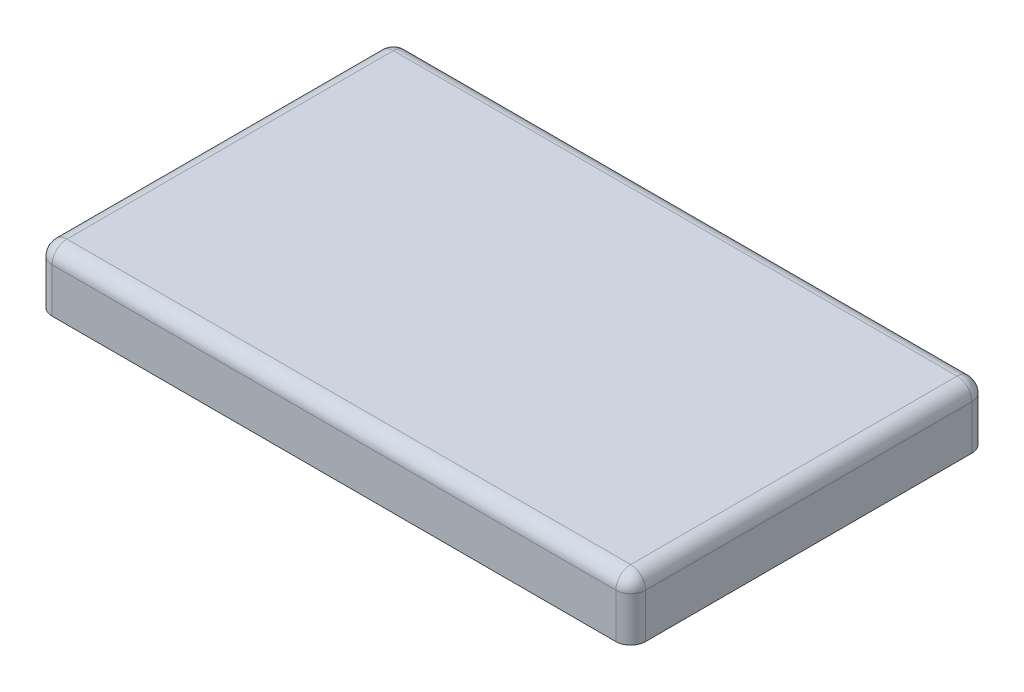
ISO-10303-21;
HEADER;
FILE_DESCRIPTION(('STEP AP214'),'2;1');
FILE_NAME('part.step','',(''),(''),'','','');
FILE_SCHEMA(('AUTOMOTIVE_DESIGN { 1 0 10303 214 1 1 1 1 }'));
ENDSEC;
DATA;
#1=APPLICATION_CONTEXT('core data for automotive mechanical design processes');
#2=APPLICATION_PROTOCOL_DEFINITION('international standard','automotive_design',2000,#1);
#3=PRODUCT_CONTEXT('',#1,'mechanical');
#4=PRODUCT('Part','Part','',(#3));
#5=PRODUCT_RELATED_PRODUCT_CATEGORY('part','',(#4));
#6=PRODUCT_DEFINITION_FORMATION('','',#4);
#7=PRODUCT_DEFINITION_CONTEXT('part definition',#1,'design');
#8=PRODUCT_DEFINITION('design','',#6,#7);
#9=PRODUCT_DEFINITION_SHAPE('','',#8);
#10=(LENGTH_UNIT() NAMED_UNIT(*) SI_UNIT(.MILLI.,.METRE.));
#11=(NAMED_UNIT(*) PLANE_ANGLE_UNIT() SI_UNIT($,.RADIAN.));
#12=(NAMED_UNIT(*) SI_UNIT($,.STERADIAN.) SOLID_ANGLE_UNIT());
#13=UNCERTAINTY_MEASURE_WITH_UNIT(LENGTH_MEASURE(1.E-05),#10,'distance_accuracy_value','');
#14=(GEOMETRIC_REPRESENTATION_CONTEXT(3) GLOBAL_UNCERTAINTY_ASSIGNED_CONTEXT((#13)) GLOBAL_UNIT_ASSIGNED_CONTEXT((#10,
#11,#12)) REPRESENTATION_CONTEXT('',''));
#15=CARTESIAN_POINT('',(0.,0.,0.));
#16=DIRECTION('',(0.,0.,1.));
#17=DIRECTION('',(1.,0.,0.));
#18=AXIS2_PLACEMENT_3D('',#15,#16,#17);
#19=CARTESIAN_POINT('',(-47.5,10.,27.5));
#20=DIRECTION('',(0.,-1.,0.));
#21=DIRECTION('',(0.,0.,-1.));
#22=AXIS2_PLACEMENT_3D('',#19,#20,#21);
#23=CYLINDRICAL_SURFACE('',#22,2.5);
#24=DIRECTION('',(0.,-1.,0.));
#25=VECTOR('',#24,1.);
#26=CARTESIAN_POINT('',(-47.5,10.,30.));
#27=LINE('',#26,#25);
#28=CARTESIAN_POINT('',(-47.5,7.5,30.));
#29=VERTEX_POINT('',#28);
#30=CARTESIAN_POINT('',(-47.5,0.,30.));
#31=VERTEX_POINT('',#30);
#32=EDGE_CURVE('E253',#29,#31,#27,.T.);
#33=ORIENTED_EDGE('',*,*,#32,.F.);
#34=CARTESIAN_POINT('',(-47.5,7.5,27.5));
#35=DIRECTION('',(0.,-1.,0.));
#36=DIRECTION('',(0.,0.,-1.));
#37=AXIS2_PLACEMENT_3D('',#34,#35,#36);
#38=CIRCLE('',#37,2.5);
#39=CARTESIAN_POINT('',(-50.,7.5,27.5));
#40=VERTEX_POINT('',#39);
#41=EDGE_CURVE('E279',#29,#40,#38,.T.);
#42=ORIENTED_EDGE('',*,*,#41,.T.);
#43=DIRECTION('',(0.,-1.,0.));
#44=VECTOR('',#43,1.);
#45=CARTESIAN_POINT('',(-50.,10.,27.5));
#46=LINE('',#45,#44);
#47=CARTESIAN_POINT('',(-50.,0.,27.5));
#48=VERTEX_POINT('',#47);
#49=EDGE_CURVE('E238',#40,#48,#46,.T.);
#50=ORIENTED_EDGE('',*,*,#49,.T.);
#51=CARTESIAN_POINT('',(-47.5,0.,27.5));
#52=DIRECTION('',(0.,1.,0.));
#53=DIRECTION('',(0.,0.,-1.));
#54=AXIS2_PLACEMENT_3D('',#51,#52,#53);
#55=CIRCLE('',#54,2.5);
#56=EDGE_CURVE('E186',#48,#31,#55,.T.);
#57=ORIENTED_EDGE('',*,*,#56,.T.);
#58=EDGE_LOOP('',(#33,#42,#50,#57));
#59=FACE_BOUND('',#58,.T.);
#60=ADVANCED_FACE('F33',(#59),#23,.T.);
#61=CARTESIAN_POINT('',(-47.5,10.,30.));
#62=DIRECTION('',(0.,0.,-1.));
#63=DIRECTION('',(-1.,0.,0.));
#64=AXIS2_PLACEMENT_3D('',#61,#62,#63);
#65=PLANE('',#64);
#66=DIRECTION('',(0.,-1.,0.));
#67=VECTOR('',#66,1.);
#68=CARTESIAN_POINT('',(47.5,10.,30.));
#69=LINE('',#68,#67);
#70=CARTESIAN_POINT('',(47.5,7.5,30.));
#71=VERTEX_POINT('',#70);
#72=CARTESIAN_POINT('',(47.5,0.,30.));
#73=VERTEX_POINT('',#72);
#74=EDGE_CURVE('E251',#71,#73,#69,.T.);
#75=ORIENTED_EDGE('',*,*,#74,.F.);
#76=DIRECTION('',(1.,0.,0.));
#77=VECTOR('',#76,1.);
#78=CARTESIAN_POINT('',(-47.5,7.5,30.));
#79=LINE('',#78,#77);
#80=EDGE_CURVE('E277',#71,#29,#79,.F.);
#81=ORIENTED_EDGE('',*,*,#80,.T.);
#82=ORIENTED_EDGE('',*,*,#32,.T.);
#83=DIRECTION('',(1.,0.,0.));
#84=VECTOR('',#83,1.);
#85=CARTESIAN_POINT('',(-47.5,0.,30.));
#86=LINE('',#85,#84);
#87=EDGE_CURVE('E190',#31,#73,#86,.T.);
#88=ORIENTED_EDGE('',*,*,#87,.T.);
#89=EDGE_LOOP('',(#75,#81,#82,#88));
#90=FACE_BOUND('',#89,.T.);
#91=ADVANCED_FACE('F439',(#90),#65,.F.);
#92=CARTESIAN_POINT('',(47.5,10.,27.5));
#93=DIRECTION('',(0.,-1.,0.));
#94=DIRECTION('',(0.,0.,-1.));
#95=AXIS2_PLACEMENT_3D('',#92,#93,#94);
#96=CYLINDRICAL_SURFACE('',#95,2.5);
#97=DIRECTION('',(0.,-1.,0.));
#98=VECTOR('',#97,1.);
#99=CARTESIAN_POINT('',(50.,10.,27.5));
#100=LINE('',#99,#98);
#101=CARTESIAN_POINT('',(50.,7.5,27.5));
#102=VERTEX_POINT('',#101);
#103=CARTESIAN_POINT('',(50.,0.,27.5));
#104=VERTEX_POINT('',#103);
#105=EDGE_CURVE('E249',#102,#104,#100,.T.);
#106=ORIENTED_EDGE('',*,*,#105,.F.);
#107=CARTESIAN_POINT('',(47.5,7.5,27.5));
#108=DIRECTION('',(0.,-1.,0.));
#109=DIRECTION('',(0.,0.,-1.));
#110=AXIS2_PLACEMENT_3D('',#107,#108,#109);
#111=CIRCLE('',#110,2.5);
#112=EDGE_CURVE('E275',#102,#71,#111,.T.);
#113=ORIENTED_EDGE('',*,*,#112,.T.);
#114=ORIENTED_EDGE('',*,*,#74,.T.);
#115=CARTESIAN_POINT('',(47.5,0.,27.5));
#116=DIRECTION('',(0.,1.,0.));
#117=DIRECTION('',(0.,0.,1.));
#118=AXIS2_PLACEMENT_3D('',#115,#116,#117);
#119=CIRCLE('',#118,2.5);
#120=EDGE_CURVE('E220',#73,#104,#119,.T.);
#121=ORIENTED_EDGE('',*,*,#120,.T.);
#122=EDGE_LOOP('',(#106,#113,#114,#121));
#123=FACE_BOUND('',#122,.T.);
#124=ADVANCED_FACE('F386',(#123),#96,.T.);
#125=CARTESIAN_POINT('',(50.,10.,27.5));
#126=DIRECTION('',(-1.,0.,0.));
#127=DIRECTION('',(0.,0.,1.));
#128=AXIS2_PLACEMENT_3D('',#125,#126,#127);
#129=PLANE('',#128);
#130=DIRECTION('',(0.,-1.,0.));
#131=VECTOR('',#130,1.);
#132=CARTESIAN_POINT('',(50.,10.,-27.5));
#133=LINE('',#132,#131);
#134=CARTESIAN_POINT('',(50.,7.5,-27.5));
#135=VERTEX_POINT('',#134);
#136=CARTESIAN_POINT('',(50.,0.,-27.5));
#137=VERTEX_POINT('',#136);
#138=EDGE_CURVE('E247',#135,#137,#133,.T.);
#139=ORIENTED_EDGE('',*,*,#138,.F.);
#140=DIRECTION('',(0.,0.,-1.));
#141=VECTOR('',#140,1.);
#142=CARTESIAN_POINT('',(50.,7.5,27.5));
#143=LINE('',#142,#141);
#144=EDGE_CURVE('E273',#135,#102,#143,.F.);
#145=ORIENTED_EDGE('',*,*,#144,.T.);
#146=ORIENTED_EDGE('',*,*,#105,.T.);
#147=DIRECTION('',(0.,0.,-1.));
#148=VECTOR('',#147,1.);
#149=CARTESIAN_POINT('',(50.,0.,27.5));
#150=LINE('',#149,#148);
#151=EDGE_CURVE('E223',#104,#137,#150,.T.);
#152=ORIENTED_EDGE('',*,*,#151,.T.);
#153=EDGE_LOOP('',(#139,#145,#146,#152));
#154=FACE_BOUND('',#153,.T.);
#155=ADVANCED_FACE('F382',(#154),#129,.F.);
#156=CARTESIAN_POINT('',(47.5,10.,-27.5));
#157=DIRECTION('',(0.,-1.,0.));
#158=DIRECTION('',(0.,0.,-1.));
#159=AXIS2_PLACEMENT_3D('',#156,#157,#158);
#160=CYLINDRICAL_SURFACE('',#159,2.5);
#161=DIRECTION('',(0.,-1.,0.));
#162=VECTOR('',#161,1.);
#163=CARTESIAN_POINT('',(47.5,10.,-30.));
#164=LINE('',#163,#162);
#165=CARTESIAN_POINT('',(47.5,7.5,-30.));
#166=VERTEX_POINT('',#165);
#167=CARTESIAN_POINT('',(47.5,0.,-30.));
#168=VERTEX_POINT('',#167);
#169=EDGE_CURVE('E245',#166,#168,#164,.T.);
#170=ORIENTED_EDGE('',*,*,#169,.F.);
#171=CARTESIAN_POINT('',(47.5,7.5,-27.5));
#172=DIRECTION('',(0.,-1.,0.));
#173=DIRECTION('',(0.,0.,-1.));
#174=AXIS2_PLACEMENT_3D('',#171,#172,#173);
#175=CIRCLE('',#174,2.5);
#176=EDGE_CURVE('E271',#166,#135,#175,.T.);
#177=ORIENTED_EDGE('',*,*,#176,.T.);
#178=ORIENTED_EDGE('',*,*,#138,.T.);
#179=CARTESIAN_POINT('',(47.5,0.,-27.5));
#180=DIRECTION('',(0.,1.,0.));
#181=DIRECTION('',(0.,0.,-1.));
#182=AXIS2_PLACEMENT_3D('',#179,#180,#181);
#183=CIRCLE('',#182,2.5);
#184=EDGE_CURVE('E226',#137,#168,#183,.T.);
#185=ORIENTED_EDGE('',*,*,#184,.T.);
#186=EDGE_LOOP('',(#170,#177,#178,#185));
#187=FACE_BOUND('',#186,.T.);
#188=ADVANCED_FACE('F378',(#187),#160,.T.);
#189=CARTESIAN_POINT('',(-47.5,10.,-30.));
#190=DIRECTION('',(0.,0.,1.));
#191=DIRECTION('',(1.,0.,0.));
#192=AXIS2_PLACEMENT_3D('',#189,#190,#191);
#193=PLANE('',#192);
#194=DIRECTION('',(0.,-1.,0.));
#195=VECTOR('',#194,1.);
#196=CARTESIAN_POINT('',(-47.5,10.,-30.));
#197=LINE('',#196,#195);
#198=CARTESIAN_POINT('',(-47.5,7.5,-30.));
#199=VERTEX_POINT('',#198);
#200=CARTESIAN_POINT('',(-47.5,0.,-30.));
#201=VERTEX_POINT('',#200);
#202=EDGE_CURVE('E243',#199,#201,#197,.T.);
#203=ORIENTED_EDGE('',*,*,#202,.F.);
#204=DIRECTION('',(-1.,0.,0.));
#205=VECTOR('',#204,1.);
#206=CARTESIAN_POINT('',(-47.5,7.5,-30.));
#207=LINE('',#206,#205);
#208=EDGE_CURVE('E269',#199,#166,#207,.F.);
#209=ORIENTED_EDGE('',*,*,#208,.T.);
#210=ORIENTED_EDGE('',*,*,#169,.T.);
#211=DIRECTION('',(-1.,0.,0.));
#212=VECTOR('',#211,1.);
#213=CARTESIAN_POINT('',(-47.5,0.,-30.));
#214=LINE('',#213,#212);
#215=EDGE_CURVE('E229',#168,#201,#214,.T.);
#216=ORIENTED_EDGE('',*,*,#215,.T.);
#217=EDGE_LOOP('',(#203,#209,#210,#216));
#218=FACE_BOUND('',#217,.T.);
#219=ADVANCED_FACE('F374',(#218),#193,.F.);
#220=CARTESIAN_POINT('',(-47.5,10.,-27.5));
#221=DIRECTION('',(0.,-1.,0.));
#222=DIRECTION('',(0.,0.,-1.));
#223=AXIS2_PLACEMENT_3D('',#220,#221,#222);
#224=CYLINDRICAL_SURFACE('',#223,2.5);
#225=DIRECTION('',(0.,-1.,0.));
#226=VECTOR('',#225,1.);
#227=CARTESIAN_POINT('',(-50.,10.,-27.5));
#228=LINE('',#227,#226);
#229=CARTESIAN_POINT('',(-50.,7.5,-27.5));
#230=VERTEX_POINT('',#229);
#231=CARTESIAN_POINT('',(-50.,0.,-27.5));
#232=VERTEX_POINT('',#231);
#233=EDGE_CURVE('E241',#230,#232,#228,.T.);
#234=ORIENTED_EDGE('',*,*,#233,.F.);
#235=CARTESIAN_POINT('',(-47.5,7.5,-27.5));
#236=DIRECTION('',(0.,-1.,0.));
#237=DIRECTION('',(0.,0.,-1.));
#238=AXIS2_PLACEMENT_3D('',#235,#236,#237);
#239=CIRCLE('',#238,2.5);
#240=EDGE_CURVE('E267',#230,#199,#239,.T.);
#241=ORIENTED_EDGE('',*,*,#240,.T.);
#242=ORIENTED_EDGE('',*,*,#202,.T.);
#243=CARTESIAN_POINT('',(-47.5,0.,-27.5));
#244=DIRECTION('',(0.,1.,0.));
#245=DIRECTION('',(0.,0.,-1.));
#246=AXIS2_PLACEMENT_3D('',#243,#244,#245);
#247=CIRCLE('',#246,2.5);
#248=EDGE_CURVE('E232',#201,#232,#247,.T.);
#249=ORIENTED_EDGE('',*,*,#248,.T.);
#250=EDGE_LOOP('',(#234,#241,#242,#249));
#251=FACE_BOUND('',#250,.T.);
#252=ADVANCED_FACE('F369',(#251),#224,.T.);
#253=CARTESIAN_POINT('',(-50.,10.,27.5));
#254=DIRECTION('',(1.,0.,0.));
#255=DIRECTION('',(0.,0.,-1.));
#256=AXIS2_PLACEMENT_3D('',#253,#254,#255);
#257=PLANE('',#256);
#258=ORIENTED_EDGE('',*,*,#49,.F.);
#259=DIRECTION('',(0.,0.,1.));
#260=VECTOR('',#259,1.);
#261=CARTESIAN_POINT('',(-50.,7.5,27.5));
#262=LINE('',#261,#260);
#263=EDGE_CURVE('E264',#40,#230,#262,.F.);
#264=ORIENTED_EDGE('',*,*,#263,.T.);
#265=ORIENTED_EDGE('',*,*,#233,.T.);
#266=DIRECTION('',(0.,0.,1.));
#267=VECTOR('',#266,1.);
#268=CARTESIAN_POINT('',(-50.,0.,27.5));
#269=LINE('',#268,#267);
#270=EDGE_CURVE('E235',#232,#48,#269,.T.);
#271=ORIENTED_EDGE('',*,*,#270,.T.);
#272=EDGE_LOOP('',(#258,#264,#265,#271));
#273=FACE_BOUND('',#272,.T.);
#274=ADVANCED_FACE('F404',(#273),#257,.F.);
#275=CARTESIAN_POINT('',(-47.5,10.,27.5));
#276=DIRECTION('',(0.,-1.,0.));
#277=DIRECTION('',(0.,0.,-1.));
#278=AXIS2_PLACEMENT_3D('',#275,#276,#277);
#279=PLANE('',#278);
#280=DIRECTION('',(-1.,0.,0.));
#281=VECTOR('',#280,1.);
#282=CARTESIAN_POINT('',(-47.5,10.,-27.5));
#283=LINE('',#282,#281);
#284=CARTESIAN_POINT('',(47.5,10.,-27.5));
#285=VERTEX_POINT('',#284);
#286=CARTESIAN_POINT('',(-47.5,10.,-27.5));
#287=VERTEX_POINT('',#286);
#288=EDGE_CURVE('E259',#285,#287,#283,.T.);
#289=ORIENTED_EDGE('',*,*,#288,.T.);
#290=DIRECTION('',(0.,0.,1.));
#291=VECTOR('',#290,1.);
#292=CARTESIAN_POINT('',(-47.5,10.,27.5));
#293=LINE('',#292,#291);
#294=CARTESIAN_POINT('',(-47.5,10.,27.5));
#295=VERTEX_POINT('',#294);
#296=EDGE_CURVE('E261',#287,#295,#293,.T.);
#297=ORIENTED_EDGE('',*,*,#296,.T.);
#298=DIRECTION('',(1.,0.,0.));
#299=VECTOR('',#298,1.);
#300=CARTESIAN_POINT('',(-47.5,10.,27.5));
#301=LINE('',#300,#299);
#302=CARTESIAN_POINT('',(47.5,10.,27.5));
#303=VERTEX_POINT('',#302);
#304=EDGE_CURVE('E255',#295,#303,#301,.T.);
#305=ORIENTED_EDGE('',*,*,#304,.T.);
#306=DIRECTION('',(0.,0.,-1.));
#307=VECTOR('',#306,1.);
#308=CARTESIAN_POINT('',(47.5,10.,27.5));
#309=LINE('',#308,#307);
#310=EDGE_CURVE('E257',#303,#285,#309,.T.);
#311=ORIENTED_EDGE('',*,*,#310,.T.);
#312=EDGE_LOOP('',(#289,#297,#305,#311));
#313=FACE_BOUND('',#312,.T.);
#314=ADVANCED_FACE('F422',(#313),#279,.F.);
#315=CARTESIAN_POINT('',(-47.5,10.,27.5));
#316=DIRECTION('',(0.,-1.,0.));
#317=DIRECTION('',(0.,0.,-1.));
#318=AXIS2_PLACEMENT_3D('',#315,#316,#317);
#319=CYLINDRICAL_SURFACE('',#318,1.25);
#320=DIRECTION('',(0.,1.,0.));
#321=VECTOR('',#320,1.);
#322=CARTESIAN_POINT('',(-47.5,10.,28.75));
#323=LINE('',#322,#321);
#324=CARTESIAN_POINT('',(-47.5,8.75,28.75));
#325=VERTEX_POINT('',#324);
#326=CARTESIAN_POINT('',(-47.5,1.24999999999998,28.75));
#327=VERTEX_POINT('',#326);
#328=EDGE_CURVE('E177',#325,#327,#323,.F.);
#329=ORIENTED_EDGE('',*,*,#328,.T.);
#330=CARTESIAN_POINT('',(-47.5,1.24999999999998,27.5));
#331=DIRECTION('',(0.,-1.,0.));
#332=DIRECTION('',(0.,0.,-1.));
#333=AXIS2_PLACEMENT_3D('',#330,#331,#332);
#334=CIRCLE('',#333,1.25);
#335=CARTESIAN_POINT('',(-48.75,1.24999999999998,27.5));
#336=VERTEX_POINT('',#335);
#337=EDGE_CURVE('E307',#327,#336,#334,.T.);
#338=ORIENTED_EDGE('',*,*,#337,.T.);
#339=DIRECTION('',(0.,-1.,0.));
#340=VECTOR('',#339,1.);
#341=CARTESIAN_POINT('',(-48.75,10.,27.5));
#342=LINE('',#341,#340);
#343=CARTESIAN_POINT('',(-48.75,8.75,27.5));
#344=VERTEX_POINT('',#343);
#345=EDGE_CURVE('E180',#344,#336,#342,.T.);
#346=ORIENTED_EDGE('',*,*,#345,.F.);
#347=CARTESIAN_POINT('',(-47.5,8.75,27.5));
#348=DIRECTION('',(0.,-1.,0.));
#349=DIRECTION('',(0.,0.,-1.));
#350=AXIS2_PLACEMENT_3D('',#347,#348,#349);
#351=CIRCLE('',#350,1.25);
#352=EDGE_CURVE('E165',#344,#325,#351,.F.);
#353=ORIENTED_EDGE('',*,*,#352,.T.);
#354=EDGE_LOOP('',(#329,#338,#346,#353));
#355=FACE_BOUND('',#354,.T.);
#356=ADVANCED_FACE('F176',(#355),#319,.F.);
#357=CARTESIAN_POINT('',(-47.5,10.,28.75));
#358=DIRECTION('',(0.,0.,-1.));
#359=DIRECTION('',(-1.,0.,0.));
#360=AXIS2_PLACEMENT_3D('',#357,#358,#359);
#361=PLANE('',#360);
#362=DIRECTION('',(0.,-1.,0.));
#363=VECTOR('',#362,1.);
#364=CARTESIAN_POINT('',(47.5,10.,28.75));
#365=LINE('',#364,#363);
#366=CARTESIAN_POINT('',(47.5,8.75,28.75));
#367=VERTEX_POINT('',#366);
#368=CARTESIAN_POINT('',(47.5,1.24999999999998,28.75));
#369=VERTEX_POINT('',#368);
#370=EDGE_CURVE('E187',#367,#369,#365,.T.);
#371=ORIENTED_EDGE('',*,*,#370,.T.);
#372=DIRECTION('',(-1.,0.,0.));
#373=VECTOR('',#372,1.);
#374=CARTESIAN_POINT('',(-47.5,1.24999999999998,28.75));
#375=LINE('',#374,#373);
#376=EDGE_CURVE('E185',#369,#327,#375,.T.);
#377=ORIENTED_EDGE('',*,*,#376,.T.);
#378=ORIENTED_EDGE('',*,*,#328,.F.);
#379=DIRECTION('',(1.,0.,0.));
#380=VECTOR('',#379,1.);
#381=CARTESIAN_POINT('',(-47.5,8.75,28.75));
#382=LINE('',#381,#380);
#383=EDGE_CURVE('E161',#325,#367,#382,.T.);
#384=ORIENTED_EDGE('',*,*,#383,.T.);
#385=EDGE_LOOP('',(#371,#377,#378,#384));
#386=FACE_BOUND('',#385,.T.);
#387=ADVANCED_FACE('F183',(#386),#361,.T.);
#388=CARTESIAN_POINT('',(47.5,10.,27.5));
#389=DIRECTION('',(0.,-1.,0.));
#390=DIRECTION('',(0.,0.,-1.));
#391=AXIS2_PLACEMENT_3D('',#388,#389,#390);
#392=CYLINDRICAL_SURFACE('',#391,1.25);
#393=DIRECTION('',(0.,1.,0.));
#394=VECTOR('',#393,1.);
#395=CARTESIAN_POINT('',(48.75,10.,27.5));
#396=LINE('',#395,#394);
#397=CARTESIAN_POINT('',(48.75,8.75,27.5));
#398=VERTEX_POINT('',#397);
#399=CARTESIAN_POINT('',(48.75,1.24999999999998,27.5));
#400=VERTEX_POINT('',#399);
#401=EDGE_CURVE('E192',#398,#400,#396,.F.);
#402=ORIENTED_EDGE('',*,*,#401,.T.);
#403=CARTESIAN_POINT('',(47.5,1.24999999999998,27.5));
#404=DIRECTION('',(0.,-1.,0.));
#405=DIRECTION('',(0.,0.,-1.));
#406=AXIS2_PLACEMENT_3D('',#403,#404,#405);
#407=CIRCLE('',#406,1.25);
#408=EDGE_CURVE('E11',#400,#369,#407,.T.);
#409=ORIENTED_EDGE('',*,*,#408,.T.);
#410=ORIENTED_EDGE('',*,*,#370,.F.);
#411=CARTESIAN_POINT('',(47.5,8.75,27.5));
#412=DIRECTION('',(0.,-1.,0.));
#413=DIRECTION('',(0.,0.,-1.));
#414=AXIS2_PLACEMENT_3D('',#411,#412,#413);
#415=CIRCLE('',#414,1.25);
#416=EDGE_CURVE('E167',#367,#398,#415,.F.);
#417=ORIENTED_EDGE('',*,*,#416,.T.);
#418=EDGE_LOOP('',(#402,#409,#410,#417));
#419=FACE_BOUND('',#418,.T.);
#420=ADVANCED_FACE('F346',(#419),#392,.F.);
#421=CARTESIAN_POINT('',(48.75,10.,27.5));
#422=DIRECTION('',(-1.,0.,0.));
#423=DIRECTION('',(0.,0.,1.));
#424=AXIS2_PLACEMENT_3D('',#421,#422,#423);
#425=PLANE('',#424);
#426=DIRECTION('',(0.,-1.,0.));
#427=VECTOR('',#426,1.);
#428=CARTESIAN_POINT('',(48.75,10.,-27.5));
#429=LINE('',#428,#427);
#430=CARTESIAN_POINT('',(48.75,8.75,-27.5));
#431=VERTEX_POINT('',#430);
#432=CARTESIAN_POINT('',(48.75,1.24999999999998,-27.5));
#433=VERTEX_POINT('',#432);
#434=EDGE_CURVE('E199',#431,#433,#429,.T.);
#435=ORIENTED_EDGE('',*,*,#434,.T.);
#436=DIRECTION('',(0.,0.,1.));
#437=VECTOR('',#436,1.);
#438=CARTESIAN_POINT('',(48.75,1.24999999999998,27.5));
#439=LINE('',#438,#437);
#440=EDGE_CURVE('E42',#433,#400,#439,.T.);
#441=ORIENTED_EDGE('',*,*,#440,.T.);
#442=ORIENTED_EDGE('',*,*,#401,.F.);
#443=DIRECTION('',(0.,0.,-1.));
#444=VECTOR('',#443,1.);
#445=CARTESIAN_POINT('',(48.75,8.75,27.5));
#446=LINE('',#445,#444);
#447=EDGE_CURVE('E201',#398,#431,#446,.T.);
#448=ORIENTED_EDGE('',*,*,#447,.T.);
#449=EDGE_LOOP('',(#435,#441,#442,#448));
#450=FACE_BOUND('',#449,.T.);
#451=ADVANCED_FACE('F347',(#450),#425,.T.);
#452=CARTESIAN_POINT('',(47.5,10.,-27.5));
#453=DIRECTION('',(0.,-1.,0.));
#454=DIRECTION('',(0.,0.,-1.));
#455=AXIS2_PLACEMENT_3D('',#452,#453,#454);
#456=CYLINDRICAL_SURFACE('',#455,1.25);
#457=DIRECTION('',(0.,1.,0.));
#458=VECTOR('',#457,1.);
#459=CARTESIAN_POINT('',(47.5,10.,-28.75));
#460=LINE('',#459,#458);
#461=CARTESIAN_POINT('',(47.5,8.75,-28.75));
#462=VERTEX_POINT('',#461);
#463=CARTESIAN_POINT('',(47.5,1.24999999999998,-28.75));
#464=VERTEX_POINT('',#463);
#465=EDGE_CURVE('E203',#462,#464,#460,.F.);
#466=ORIENTED_EDGE('',*,*,#465,.T.);
#467=CARTESIAN_POINT('',(47.5,1.24999999999998,-27.5));
#468=DIRECTION('',(0.,-1.,0.));
#469=DIRECTION('',(0.,0.,-1.));
#470=AXIS2_PLACEMENT_3D('',#467,#468,#469);
#471=CIRCLE('',#470,1.25);
#472=EDGE_CURVE('E57',#464,#433,#471,.T.);
#473=ORIENTED_EDGE('',*,*,#472,.T.);
#474=ORIENTED_EDGE('',*,*,#434,.F.);
#475=CARTESIAN_POINT('',(47.5,8.75,-27.5));
#476=DIRECTION('',(0.,-1.,0.));
#477=DIRECTION('',(0.,0.,-1.));
#478=AXIS2_PLACEMENT_3D('',#475,#476,#477);
#479=CIRCLE('',#478,1.25);
#480=EDGE_CURVE('E205',#431,#462,#479,.F.);
#481=ORIENTED_EDGE('',*,*,#480,.T.);
#482=EDGE_LOOP('',(#466,#473,#474,#481));
#483=FACE_BOUND('',#482,.T.);
#484=ADVANCED_FACE('F352',(#483),#456,.F.);
#485=CARTESIAN_POINT('',(-47.5,10.,-28.75));
#486=DIRECTION('',(0.,0.,1.));
#487=DIRECTION('',(1.,0.,0.));
#488=AXIS2_PLACEMENT_3D('',#485,#486,#487);
#489=PLANE('',#488);
#490=DIRECTION('',(0.,-1.,0.));
#491=VECTOR('',#490,1.);
#492=CARTESIAN_POINT('',(-47.5,10.,-28.75));
#493=LINE('',#492,#491);
#494=CARTESIAN_POINT('',(-47.5,8.75,-28.75));
#495=VERTEX_POINT('',#494);
#496=CARTESIAN_POINT('',(-47.5,1.24999999999998,-28.75));
#497=VERTEX_POINT('',#496);
#498=EDGE_CURVE('E207',#495,#497,#493,.T.);
#499=ORIENTED_EDGE('',*,*,#498,.T.);
#500=DIRECTION('',(1.,0.,0.));
#501=VECTOR('',#500,1.);
#502=CARTESIAN_POINT('',(-47.5,1.24999999999998,-28.75));
#503=LINE('',#502,#501);
#504=EDGE_CURVE('E309',#497,#464,#503,.T.);
#505=ORIENTED_EDGE('',*,*,#504,.T.);
#506=ORIENTED_EDGE('',*,*,#465,.F.);
#507=DIRECTION('',(-1.,0.,0.));
#508=VECTOR('',#507,1.);
#509=CARTESIAN_POINT('',(-47.5,8.75,-28.75));
#510=LINE('',#509,#508);
#511=EDGE_CURVE('E209',#462,#495,#510,.T.);
#512=ORIENTED_EDGE('',*,*,#511,.T.);
#513=EDGE_LOOP('',(#499,#505,#506,#512));
#514=FACE_BOUND('',#513,.T.);
#515=ADVANCED_FACE('F354',(#514),#489,.T.);
#516=CARTESIAN_POINT('',(-47.5,10.,-27.5));
#517=DIRECTION('',(0.,-1.,0.));
#518=DIRECTION('',(0.,0.,-1.));
#519=AXIS2_PLACEMENT_3D('',#516,#517,#518);
#520=CYLINDRICAL_SURFACE('',#519,1.25);
#521=DIRECTION('',(0.,1.,0.));
#522=VECTOR('',#521,1.);
#523=CARTESIAN_POINT('',(-48.75,10.,-27.5));
#524=LINE('',#523,#522);
#525=CARTESIAN_POINT('',(-48.75,8.75,-27.5));
#526=VERTEX_POINT('',#525);
#527=CARTESIAN_POINT('',(-48.75,1.24999999999998,-27.5));
#528=VERTEX_POINT('',#527);
#529=EDGE_CURVE('E195',#526,#528,#524,.F.);
#530=ORIENTED_EDGE('',*,*,#529,.T.);
#531=CARTESIAN_POINT('',(-47.5,1.24999999999998,-27.5));
#532=DIRECTION('',(0.,-1.,0.));
#533=DIRECTION('',(0.,0.,-1.));
#534=AXIS2_PLACEMENT_3D('',#531,#532,#533);
#535=CIRCLE('',#534,1.25);
#536=EDGE_CURVE('E305',#528,#497,#535,.T.);
#537=ORIENTED_EDGE('',*,*,#536,.T.);
#538=ORIENTED_EDGE('',*,*,#498,.F.);
#539=CARTESIAN_POINT('',(-47.5,8.75,-27.5));
#540=DIRECTION('',(0.,-1.,0.));
#541=DIRECTION('',(0.,0.,-1.));
#542=AXIS2_PLACEMENT_3D('',#539,#540,#541);
#543=CIRCLE('',#542,1.25);
#544=EDGE_CURVE('E213',#495,#526,#543,.F.);
#545=ORIENTED_EDGE('',*,*,#544,.T.);
#546=EDGE_LOOP('',(#530,#537,#538,#545));
#547=FACE_BOUND('',#546,.T.);
#548=ADVANCED_FACE('F616',(#547),#520,.F.);
#549=CARTESIAN_POINT('',(-48.75,10.,27.5));
#550=DIRECTION('',(1.,0.,0.));
#551=DIRECTION('',(0.,0.,-1.));
#552=AXIS2_PLACEMENT_3D('',#549,#550,#551);
#553=PLANE('',#552);
#554=ORIENTED_EDGE('',*,*,#345,.T.);
#555=DIRECTION('',(0.,0.,-1.));
#556=VECTOR('',#555,1.);
#557=CARTESIAN_POINT('',(-48.75,1.24999999999998,27.5));
#558=LINE('',#557,#556);
#559=EDGE_CURVE('E281',#336,#528,#558,.T.);
#560=ORIENTED_EDGE('',*,*,#559,.T.);
#561=ORIENTED_EDGE('',*,*,#529,.F.);
#562=DIRECTION('',(0.,0.,1.));
#563=VECTOR('',#562,1.);
#564=CARTESIAN_POINT('',(-48.75,8.75,27.5));
#565=LINE('',#564,#563);
#566=EDGE_CURVE('E196',#526,#344,#565,.T.);
#567=ORIENTED_EDGE('',*,*,#566,.T.);
#568=EDGE_LOOP('',(#554,#560,#561,#567));
#569=FACE_BOUND('',#568,.T.);
#570=ADVANCED_FACE('F398',(#569),#553,.T.);
#571=CARTESIAN_POINT('',(-47.5,8.75,27.5));
#572=DIRECTION('',(0.,-1.,0.));
#573=DIRECTION('',(0.,0.,-1.));
#574=AXIS2_PLACEMENT_3D('',#571,#572,#573);
#575=PLANE('',#574);
#576=ORIENTED_EDGE('',*,*,#352,.F.);
#577=ORIENTED_EDGE('',*,*,#566,.F.);
#578=ORIENTED_EDGE('',*,*,#544,.F.);
#579=ORIENTED_EDGE('',*,*,#511,.F.);
#580=ORIENTED_EDGE('',*,*,#480,.F.);
#581=ORIENTED_EDGE('',*,*,#447,.F.);
#582=ORIENTED_EDGE('',*,*,#416,.F.);
#583=ORIENTED_EDGE('',*,*,#383,.F.);
#584=EDGE_LOOP('',(#576,#577,#578,#579,#580,#581,#582,#583));
#585=FACE_BOUND('',#584,.T.);
#586=ADVANCED_FACE('F163',(#585),#575,.T.);
#587=CARTESIAN_POINT('',(47.5,7.5,27.5));
#588=DIRECTION('',(0.,0.,-1.));
#589=DIRECTION('',(-1.,0.,0.));
#590=AXIS2_PLACEMENT_3D('',#587,#588,#589);
#591=CYLINDRICAL_SURFACE('',#590,2.5);
#592=CARTESIAN_POINT('',(47.5,7.5,27.5));
#593=DIRECTION('',(0.,0.,1.));
#594=DIRECTION('',(1.,0.,0.));
#595=AXIS2_PLACEMENT_3D('',#592,#593,#594);
#596=CIRCLE('',#595,2.5);
#597=EDGE_CURVE('E298',#102,#303,#596,.T.);
#598=ORIENTED_EDGE('',*,*,#597,.F.);
#599=ORIENTED_EDGE('',*,*,#144,.F.);
#600=CARTESIAN_POINT('',(47.5,7.5,-27.5));
#601=DIRECTION('',(0.,0.,-1.));
#602=DIRECTION('',(-1.,0.,0.));
#603=AXIS2_PLACEMENT_3D('',#600,#601,#602);
#604=CIRCLE('',#603,2.5);
#605=EDGE_CURVE('E181',#285,#135,#604,.T.);
#606=ORIENTED_EDGE('',*,*,#605,.F.);
#607=ORIENTED_EDGE('',*,*,#310,.F.);
#608=EDGE_LOOP('',(#598,#599,#606,#607));
#609=FACE_BOUND('',#608,.T.);
#610=ADVANCED_FACE('F472',(#609),#591,.T.);
#611=CARTESIAN_POINT('',(47.5,7.5,-27.5));
#612=DIRECTION('',(0.,0.,1.));
#613=DIRECTION('',(1.,0.,0.));
#614=AXIS2_PLACEMENT_3D('',#611,#612,#613);
#615=SPHERICAL_SURFACE('',#614,2.5);
#616=ORIENTED_EDGE('',*,*,#605,.T.);
#617=ORIENTED_EDGE('',*,*,#176,.F.);
#618=CARTESIAN_POINT('',(47.5,7.5,-27.5));
#619=DIRECTION('',(-1.,0.,0.));
#620=DIRECTION('',(0.,0.,1.));
#621=AXIS2_PLACEMENT_3D('',#618,#619,#620);
#622=CIRCLE('',#621,2.5);
#623=EDGE_CURVE('E295',#285,#166,#622,.T.);
#624=ORIENTED_EDGE('',*,*,#623,.F.);
#625=EDGE_LOOP('',(#616,#617,#624));
#626=FACE_BOUND('',#625,.T.);
#627=ADVANCED_FACE('F475',(#626),#615,.T.);
#628=CARTESIAN_POINT('',(47.5,7.5,27.5));
#629=DIRECTION('',(0.,0.,1.));
#630=DIRECTION('',(1.,0.,0.));
#631=AXIS2_PLACEMENT_3D('',#628,#629,#630);
#632=SPHERICAL_SURFACE('',#631,2.5);
#633=ORIENTED_EDGE('',*,*,#112,.F.);
#634=ORIENTED_EDGE('',*,*,#597,.T.);
#635=CARTESIAN_POINT('',(47.5,7.5,27.5));
#636=DIRECTION('',(-1.,0.,0.));
#637=DIRECTION('',(0.,0.,1.));
#638=AXIS2_PLACEMENT_3D('',#635,#636,#637);
#639=CIRCLE('',#638,2.5);
#640=EDGE_CURVE('E292',#71,#303,#639,.T.);
#641=ORIENTED_EDGE('',*,*,#640,.F.);
#642=EDGE_LOOP('',(#633,#634,#641));
#643=FACE_BOUND('',#642,.T.);
#644=ADVANCED_FACE('F479',(#643),#632,.T.);
#645=CARTESIAN_POINT('',(-47.5,7.5,-27.5));
#646=DIRECTION('',(-1.,0.,0.));
#647=DIRECTION('',(0.,0.,1.));
#648=AXIS2_PLACEMENT_3D('',#645,#646,#647);
#649=CYLINDRICAL_SURFACE('',#648,2.5);
#650=ORIENTED_EDGE('',*,*,#623,.T.);
#651=ORIENTED_EDGE('',*,*,#208,.F.);
#652=CARTESIAN_POINT('',(-47.5,7.5,-27.5));
#653=DIRECTION('',(-1.,0.,0.));
#654=DIRECTION('',(0.,0.,1.));
#655=AXIS2_PLACEMENT_3D('',#652,#653,#654);
#656=CIRCLE('',#655,2.5);
#657=EDGE_CURVE('E289',#287,#199,#656,.T.);
#658=ORIENTED_EDGE('',*,*,#657,.F.);
#659=ORIENTED_EDGE('',*,*,#288,.F.);
#660=EDGE_LOOP('',(#650,#651,#658,#659));
#661=FACE_BOUND('',#660,.T.);
#662=ADVANCED_FACE('F427',(#661),#649,.T.);
#663=CARTESIAN_POINT('',(-47.5,7.5,27.5));
#664=DIRECTION('',(1.,0.,0.));
#665=DIRECTION('',(0.,0.,-1.));
#666=AXIS2_PLACEMENT_3D('',#663,#664,#665);
#667=CYLINDRICAL_SURFACE('',#666,2.5);
#668=ORIENTED_EDGE('',*,*,#640,.T.);
#669=ORIENTED_EDGE('',*,*,#304,.F.);
#670=CARTESIAN_POINT('',(-47.5,7.5,27.5));
#671=DIRECTION('',(-1.,0.,0.));
#672=DIRECTION('',(0.,0.,1.));
#673=AXIS2_PLACEMENT_3D('',#670,#671,#672);
#674=CIRCLE('',#673,2.5);
#675=EDGE_CURVE('E286',#29,#295,#674,.T.);
#676=ORIENTED_EDGE('',*,*,#675,.F.);
#677=ORIENTED_EDGE('',*,*,#80,.F.);
#678=EDGE_LOOP('',(#668,#669,#676,#677));
#679=FACE_BOUND('',#678,.T.);
#680=ADVANCED_FACE('F418',(#679),#667,.T.);
#681=CARTESIAN_POINT('',(-47.5,7.5,-27.5));
#682=DIRECTION('',(0.,0.,1.));
#683=DIRECTION('',(1.,0.,0.));
#684=AXIS2_PLACEMENT_3D('',#681,#682,#683);
#685=SPHERICAL_SURFACE('',#684,2.5);
#686=ORIENTED_EDGE('',*,*,#657,.T.);
#687=ORIENTED_EDGE('',*,*,#240,.F.);
#688=CARTESIAN_POINT('',(-47.5,7.5,-27.5));
#689=DIRECTION('',(0.,0.,1.));
#690=DIRECTION('',(1.,0.,0.));
#691=AXIS2_PLACEMENT_3D('',#688,#689,#690);
#692=CIRCLE('',#691,2.5);
#693=EDGE_CURVE('E284',#287,#230,#692,.T.);
#694=ORIENTED_EDGE('',*,*,#693,.F.);
#695=EDGE_LOOP('',(#686,#687,#694));
#696=FACE_BOUND('',#695,.T.);
#697=ADVANCED_FACE('F429',(#696),#685,.T.);
#698=CARTESIAN_POINT('',(-47.5,7.5,27.5));
#699=DIRECTION('',(0.,0.,1.));
#700=DIRECTION('',(1.,0.,0.));
#701=AXIS2_PLACEMENT_3D('',#698,#699,#700);
#702=SPHERICAL_SURFACE('',#701,2.5);
#703=ORIENTED_EDGE('',*,*,#41,.F.);
#704=ORIENTED_EDGE('',*,*,#675,.T.);
#705=CARTESIAN_POINT('',(-47.5,7.5,27.5));
#706=DIRECTION('',(0.,0.,-1.));
#707=DIRECTION('',(-1.,0.,0.));
#708=AXIS2_PLACEMENT_3D('',#705,#706,#707);
#709=CIRCLE('',#708,2.5);
#710=EDGE_CURVE('E282',#40,#295,#709,.T.);
#711=ORIENTED_EDGE('',*,*,#710,.F.);
#712=EDGE_LOOP('',(#703,#704,#711));
#713=FACE_BOUND('',#712,.T.);
#714=ADVANCED_FACE('F413',(#713),#702,.T.);
#715=CARTESIAN_POINT('',(-47.5,7.5,27.5));
#716=DIRECTION('',(0.,0.,1.));
#717=DIRECTION('',(1.,0.,0.));
#718=AXIS2_PLACEMENT_3D('',#715,#716,#717);
#719=CYLINDRICAL_SURFACE('',#718,2.5);
#720=ORIENTED_EDGE('',*,*,#693,.T.);
#721=ORIENTED_EDGE('',*,*,#263,.F.);
#722=ORIENTED_EDGE('',*,*,#710,.T.);
#723=ORIENTED_EDGE('',*,*,#296,.F.);
#724=EDGE_LOOP('',(#720,#721,#722,#723));
#725=FACE_BOUND('',#724,.T.);
#726=ADVANCED_FACE('F408',(#725),#719,.T.);
#727=CARTESIAN_POINT('',(50.,0.,27.5));
#728=DIRECTION('',(0.707106781186545,0.70710678118655,0.));
#729=DIRECTION('',(-0.70710678118655,0.707106781186545,0.));
#730=AXIS2_PLACEMENT_3D('',#727,#728,#729);
#731=PLANE('',#730);
#732=DIRECTION('',(0.70710678118655,-0.707106781186545,0.));
#733=VECTOR('',#732,1.);
#734=CARTESIAN_POINT('',(48.75,1.24999999999998,27.5));
#735=LINE('',#734,#733);
#736=EDGE_CURVE('E329',#400,#104,#735,.T.);
#737=ORIENTED_EDGE('',*,*,#736,.F.);
#738=ORIENTED_EDGE('',*,*,#440,.F.);
#739=DIRECTION('',(-0.70710678118655,0.707106781186545,0.));
#740=VECTOR('',#739,1.);
#741=CARTESIAN_POINT('',(50.,0.,-27.5));
#742=LINE('',#741,#740);
#743=EDGE_CURVE('E37',#137,#433,#742,.T.);
#744=ORIENTED_EDGE('',*,*,#743,.F.);
#745=ORIENTED_EDGE('',*,*,#151,.F.);
#746=EDGE_LOOP('',(#737,#738,#744,#745));
#747=FACE_BOUND('',#746,.T.);
#748=ADVANCED_FACE('F35',(#747),#731,.F.);
#749=CARTESIAN_POINT('',(47.5,0.,-27.5));
#750=DIRECTION('',(0.,-1.,0.));
#751=DIRECTION('',(0.,0.,-1.));
#752=AXIS2_PLACEMENT_3D('',#749,#750,#751);
#753=CONICAL_SURFACE('',#752,2.49999999999999,0.785398163397452);
#754=ORIENTED_EDGE('',*,*,#743,.T.);
#755=ORIENTED_EDGE('',*,*,#472,.F.);
#756=DIRECTION('',(0.,0.707106781186545,0.70710678118655));
#757=VECTOR('',#756,1.);
#758=CARTESIAN_POINT('',(47.5,0.,-30.));
#759=LINE('',#758,#757);
#760=EDGE_CURVE('E327',#168,#464,#759,.T.);
#761=ORIENTED_EDGE('',*,*,#760,.F.);
#762=ORIENTED_EDGE('',*,*,#184,.F.);
#763=EDGE_LOOP('',(#754,#755,#761,#762));
#764=FACE_BOUND('',#763,.T.);
#765=ADVANCED_FACE('F339',(#764),#753,.F.);
#766=CARTESIAN_POINT('',(47.5,0.,27.5));
#767=DIRECTION('',(0.,-1.,0.));
#768=DIRECTION('',(0.,0.,-1.));
#769=AXIS2_PLACEMENT_3D('',#766,#767,#768);
#770=CONICAL_SURFACE('',#769,2.49999999999998,0.785398163397451);
#771=ORIENTED_EDGE('',*,*,#736,.T.);
#772=ORIENTED_EDGE('',*,*,#120,.F.);
#773=DIRECTION('',(0.,-0.707106781186547,0.707106781186548));
#774=VECTOR('',#773,1.);
#775=CARTESIAN_POINT('',(47.5,1.24999999999998,28.75));
#776=LINE('',#775,#774);
#777=EDGE_CURVE('E324',#369,#73,#776,.T.);
#778=ORIENTED_EDGE('',*,*,#777,.F.);
#779=ORIENTED_EDGE('',*,*,#408,.F.);
#780=EDGE_LOOP('',(#771,#772,#778,#779));
#781=FACE_BOUND('',#780,.T.);
#782=ADVANCED_FACE('F344',(#781),#770,.F.);
#783=CARTESIAN_POINT('',(-47.5,0.,-30.));
#784=DIRECTION('',(0.,0.707106781186549,-0.707106781186546));
#785=DIRECTION('',(0.,0.707106781186546,0.707106781186549));
#786=AXIS2_PLACEMENT_3D('',#783,#784,#785);
#787=PLANE('',#786);
#788=ORIENTED_EDGE('',*,*,#760,.T.);
#789=ORIENTED_EDGE('',*,*,#504,.F.);
#790=DIRECTION('',(0.,0.707106781186546,0.707106781186549));
#791=VECTOR('',#790,1.);
#792=CARTESIAN_POINT('',(-47.5,0.,-30.));
#793=LINE('',#792,#791);
#794=EDGE_CURVE('E321',#201,#497,#793,.T.);
#795=ORIENTED_EDGE('',*,*,#794,.F.);
#796=ORIENTED_EDGE('',*,*,#215,.F.);
#797=EDGE_LOOP('',(#788,#789,#795,#796));
#798=FACE_BOUND('',#797,.T.);
#799=ADVANCED_FACE('F359',(#798),#787,.F.);
#800=CARTESIAN_POINT('',(-47.5,0.,30.));
#801=DIRECTION('',(0.,0.70710678118655,0.707106781186545));
#802=DIRECTION('',(0.,-0.707106781186545,0.70710678118655));
#803=AXIS2_PLACEMENT_3D('',#800,#801,#802);
#804=PLANE('',#803);
#805=ORIENTED_EDGE('',*,*,#777,.T.);
#806=ORIENTED_EDGE('',*,*,#87,.F.);
#807=DIRECTION('',(0.,-0.707106781186545,0.70710678118655));
#808=VECTOR('',#807,1.);
#809=CARTESIAN_POINT('',(-47.5,1.24999999999998,28.75));
#810=LINE('',#809,#808);
#811=EDGE_CURVE('E318',#327,#31,#810,.T.);
#812=ORIENTED_EDGE('',*,*,#811,.F.);
#813=ORIENTED_EDGE('',*,*,#376,.F.);
#814=EDGE_LOOP('',(#805,#806,#812,#813));
#815=FACE_BOUND('',#814,.T.);
#816=ADVANCED_FACE('F390',(#815),#804,.F.);
#817=CARTESIAN_POINT('',(-47.5,0.,-27.5));
#818=DIRECTION('',(0.,-1.,0.));
#819=DIRECTION('',(0.,0.,-1.));
#820=AXIS2_PLACEMENT_3D('',#817,#818,#819);
#821=CONICAL_SURFACE('',#820,2.49999999999998,0.785398163397451);
#822=ORIENTED_EDGE('',*,*,#794,.T.);
#823=ORIENTED_EDGE('',*,*,#536,.F.);
#824=DIRECTION('',(0.707106781186548,0.707106781186547,0.));
#825=VECTOR('',#824,1.);
#826=CARTESIAN_POINT('',(-50.,0.,-27.5));
#827=LINE('',#826,#825);
#828=EDGE_CURVE('E316',#232,#528,#827,.T.);
#829=ORIENTED_EDGE('',*,*,#828,.F.);
#830=ORIENTED_EDGE('',*,*,#248,.F.);
#831=EDGE_LOOP('',(#822,#823,#829,#830));
#832=FACE_BOUND('',#831,.T.);
#833=ADVANCED_FACE('F364',(#832),#821,.F.);
#834=CARTESIAN_POINT('',(-47.5,0.,27.5));
#835=DIRECTION('',(0.,-1.,0.));
#836=DIRECTION('',(0.,0.,-1.));
#837=AXIS2_PLACEMENT_3D('',#834,#835,#836);
#838=CONICAL_SURFACE('',#837,2.49999999999999,0.785398163397452);
#839=ORIENTED_EDGE('',*,*,#811,.T.);
#840=ORIENTED_EDGE('',*,*,#56,.F.);
#841=DIRECTION('',(-0.70710678118655,-0.707106781186545,0.));
#842=VECTOR('',#841,1.);
#843=CARTESIAN_POINT('',(-48.75,1.24999999999998,27.5));
#844=LINE('',#843,#842);
#845=EDGE_CURVE('E314',#336,#48,#844,.T.);
#846=ORIENTED_EDGE('',*,*,#845,.F.);
#847=ORIENTED_EDGE('',*,*,#337,.F.);
#848=EDGE_LOOP('',(#839,#840,#846,#847));
#849=FACE_BOUND('',#848,.T.);
#850=ADVANCED_FACE('F395',(#849),#838,.F.);
#851=CARTESIAN_POINT('',(-50.,0.,27.5));
#852=DIRECTION('',(-0.707106781186545,0.70710678118655,0.));
#853=DIRECTION('',(-0.70710678118655,-0.707106781186545,0.));
#854=AXIS2_PLACEMENT_3D('',#851,#852,#853);
#855=PLANE('',#854);
#856=ORIENTED_EDGE('',*,*,#828,.T.);
#857=ORIENTED_EDGE('',*,*,#559,.F.);
#858=ORIENTED_EDGE('',*,*,#845,.T.);
#859=ORIENTED_EDGE('',*,*,#270,.F.);
#860=EDGE_LOOP('',(#856,#857,#858,#859));
#861=FACE_BOUND('',#860,.T.);
#862=ADVANCED_FACE('F401',(#861),#855,.F.);
#863=CLOSED_SHELL('',(#60,#91,#124,#155,#188,#219,#252,#274,#314,#356,#387,#420,#451,#484,#515,
#548,#570,#586,#610,#627,#644,#662,#680,#697,#714,#726,#748,#765,#782,#799,#816,#833,#850,#862));
#864=MANIFOLD_SOLID_BREP('B2',#863);
#865=ADVANCED_BREP_SHAPE_REPRESENTATION('',(#18,#864),#14);
#866=SHAPE_DEFINITION_REPRESENTATION(#9,#865);
ENDSEC;
END-ISO-10303-21;
